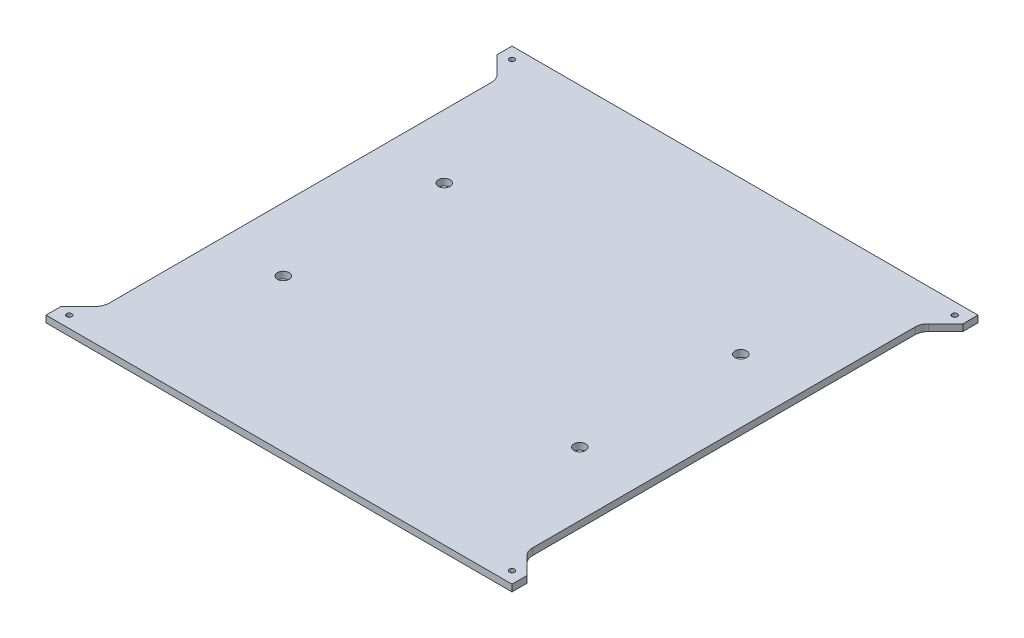
ISO-10303-21;
HEADER;
FILE_DESCRIPTION(('STEP AP214'),'2;1');
FILE_NAME('part.step','',(''),(''),'','','');
FILE_SCHEMA(('AUTOMOTIVE_DESIGN { 1 0 10303 214 1 1 1 1 }'));
ENDSEC;
DATA;
#1=APPLICATION_CONTEXT('core data for automotive mechanical design processes');
#2=APPLICATION_PROTOCOL_DEFINITION('international standard','automotive_design',2000,#1);
#3=PRODUCT_CONTEXT('',#1,'mechanical');
#4=PRODUCT('Part','Part','',(#3));
#5=PRODUCT_RELATED_PRODUCT_CATEGORY('part','',(#4));
#6=PRODUCT_DEFINITION_FORMATION('','',#4);
#7=PRODUCT_DEFINITION_CONTEXT('part definition',#1,'design');
#8=PRODUCT_DEFINITION('design','',#6,#7);
#9=PRODUCT_DEFINITION_SHAPE('','',#8);
#10=(LENGTH_UNIT() NAMED_UNIT(*) SI_UNIT(.MILLI.,.METRE.));
#11=(NAMED_UNIT(*) PLANE_ANGLE_UNIT() SI_UNIT($,.RADIAN.));
#12=(NAMED_UNIT(*) SI_UNIT($,.STERADIAN.) SOLID_ANGLE_UNIT());
#13=UNCERTAINTY_MEASURE_WITH_UNIT(LENGTH_MEASURE(1.E-05),#10,'distance_accuracy_value','');
#14=(GEOMETRIC_REPRESENTATION_CONTEXT(3) GLOBAL_UNCERTAINTY_ASSIGNED_CONTEXT((#13)) GLOBAL_UNIT_ASSIGNED_CONTEXT((#10,
#11,#12)) REPRESENTATION_CONTEXT('',''));
#15=CARTESIAN_POINT('',(0.,0.,0.));
#16=DIRECTION('',(0.,0.,1.));
#17=DIRECTION('',(1.,0.,0.));
#18=AXIS2_PLACEMENT_3D('',#15,#16,#17);
#19=CARTESIAN_POINT('',(110.,3.175,-110.));
#20=DIRECTION('',(-1.,0.,0.));
#21=DIRECTION('',(0.,0.,1.));
#22=AXIS2_PLACEMENT_3D('',#19,#20,#21);
#23=PLANE('',#22);
#24=DIRECTION('',(0.,0.,-1.));
#25=VECTOR('',#24,1.);
#26=CARTESIAN_POINT('',(110.,0.,-110.));
#27=LINE('',#26,#25);
#28=CARTESIAN_POINT('',(110.,0.,110.));
#29=VERTEX_POINT('',#28);
#30=CARTESIAN_POINT('',(110.,0.,102.928932188135));
#31=VERTEX_POINT('',#30);
#32=EDGE_CURVE('E172',#29,#31,#27,.T.);
#33=ORIENTED_EDGE('',*,*,#32,.T.);
#34=DIRECTION('',(0.,1.,0.));
#35=VECTOR('',#34,1.);
#36=CARTESIAN_POINT('',(110.,0.,102.928932188135));
#37=LINE('',#36,#35);
#38=CARTESIAN_POINT('',(110.,3.175,102.928932188135));
#39=VERTEX_POINT('',#38);
#40=EDGE_CURVE('E222',#31,#39,#37,.T.);
#41=ORIENTED_EDGE('',*,*,#40,.T.);
#42=DIRECTION('',(0.,0.,-1.));
#43=VECTOR('',#42,1.);
#44=CARTESIAN_POINT('',(110.,3.175,-110.));
#45=LINE('',#44,#43);
#46=CARTESIAN_POINT('',(110.,3.175,110.));
#47=VERTEX_POINT('',#46);
#48=EDGE_CURVE('E194',#47,#39,#45,.T.);
#49=ORIENTED_EDGE('',*,*,#48,.F.);
#50=DIRECTION('',(0.,-1.,0.));
#51=VECTOR('',#50,1.);
#52=CARTESIAN_POINT('',(110.,3.175,110.));
#53=LINE('',#52,#51);
#54=EDGE_CURVE('E43',#47,#29,#53,.T.);
#55=ORIENTED_EDGE('',*,*,#54,.T.);
#56=EDGE_LOOP('',(#33,#41,#49,#55));
#57=FACE_BOUND('',#56,.T.);
#58=ADVANCED_FACE('F35',(#57),#23,.F.);
#59=CARTESIAN_POINT('',(-110.,3.175,-110.));
#60=DIRECTION('',(1.,0.,0.));
#61=DIRECTION('',(0.,0.,-1.));
#62=AXIS2_PLACEMENT_3D('',#59,#60,#61);
#63=PLANE('',#62);
#64=DIRECTION('',(0.,0.,1.));
#65=VECTOR('',#64,1.);
#66=CARTESIAN_POINT('',(-110.,0.,-110.));
#67=LINE('',#66,#65);
#68=CARTESIAN_POINT('',(-110.,0.,-110.));
#69=VERTEX_POINT('',#68);
#70=CARTESIAN_POINT('',(-110.,0.,-102.928932188135));
#71=VERTEX_POINT('',#70);
#72=EDGE_CURVE('E176',#69,#71,#67,.T.);
#73=ORIENTED_EDGE('',*,*,#72,.T.);
#74=DIRECTION('',(0.,1.,0.));
#75=VECTOR('',#74,1.);
#76=CARTESIAN_POINT('',(-110.,0.,-102.928932188135));
#77=LINE('',#76,#75);
#78=CARTESIAN_POINT('',(-110.,3.175,-102.928932188135));
#79=VERTEX_POINT('',#78);
#80=EDGE_CURVE('E246',#71,#79,#77,.T.);
#81=ORIENTED_EDGE('',*,*,#80,.T.);
#82=DIRECTION('',(0.,0.,1.));
#83=VECTOR('',#82,1.);
#84=CARTESIAN_POINT('',(-110.,3.175,-110.));
#85=LINE('',#84,#83);
#86=CARTESIAN_POINT('',(-110.,3.175,-110.));
#87=VERTEX_POINT('',#86);
#88=EDGE_CURVE('E320',#87,#79,#85,.T.);
#89=ORIENTED_EDGE('',*,*,#88,.F.);
#90=DIRECTION('',(0.,-1.,0.));
#91=VECTOR('',#90,1.);
#92=CARTESIAN_POINT('',(-110.,3.175,-110.));
#93=LINE('',#92,#91);
#94=EDGE_CURVE('E182',#87,#69,#93,.T.);
#95=ORIENTED_EDGE('',*,*,#94,.T.);
#96=EDGE_LOOP('',(#73,#81,#89,#95));
#97=FACE_BOUND('',#96,.T.);
#98=ADVANCED_FACE('F354',(#97),#63,.F.);
#99=CARTESIAN_POINT('',(-110.,3.175,102.928932188134));
#100=VERTEX_POINT('',#99);
#101=CARTESIAN_POINT('',(-110.,3.175,110.));
#102=VERTEX_POINT('',#101);
#103=EDGE_CURVE('E181',#100,#102,#85,.T.);
#104=ORIENTED_EDGE('',*,*,#103,.F.);
#105=DIRECTION('',(0.,1.,0.));
#106=VECTOR('',#105,1.);
#107=CARTESIAN_POINT('',(-110.,0.,102.928932188134));
#108=LINE('',#107,#106);
#109=CARTESIAN_POINT('',(-110.,0.,102.928932188134));
#110=VERTEX_POINT('',#109);
#111=EDGE_CURVE('E268',#110,#100,#108,.T.);
#112=ORIENTED_EDGE('',*,*,#111,.F.);
#113=CARTESIAN_POINT('',(-110.,0.,110.));
#114=VERTEX_POINT('',#113);
#115=EDGE_CURVE('E319',#110,#114,#67,.T.);
#116=ORIENTED_EDGE('',*,*,#115,.T.);
#117=DIRECTION('',(0.,-1.,0.));
#118=VECTOR('',#117,1.);
#119=CARTESIAN_POINT('',(-110.,3.175,110.));
#120=LINE('',#119,#118);
#121=EDGE_CURVE('E11',#102,#114,#120,.T.);
#122=ORIENTED_EDGE('',*,*,#121,.F.);
#123=EDGE_LOOP('',(#104,#112,#116,#122));
#124=FACE_BOUND('',#123,.T.);
#125=ADVANCED_FACE('F37',(#124),#63,.F.);
#126=CARTESIAN_POINT('',(-110.,3.175,110.));
#127=DIRECTION('',(0.,0.,-1.));
#128=DIRECTION('',(-1.,0.,0.));
#129=AXIS2_PLACEMENT_3D('',#126,#127,#128);
#130=PLANE('',#129);
#131=DIRECTION('',(1.,0.,0.));
#132=VECTOR('',#131,1.);
#133=CARTESIAN_POINT('',(-110.,0.,110.));
#134=LINE('',#133,#132);
#135=EDGE_CURVE('E173',#114,#29,#134,.T.);
#136=ORIENTED_EDGE('',*,*,#135,.T.);
#137=ORIENTED_EDGE('',*,*,#54,.F.);
#138=DIRECTION('',(1.,0.,0.));
#139=VECTOR('',#138,1.);
#140=CARTESIAN_POINT('',(-110.,3.175,110.));
#141=LINE('',#140,#139);
#142=EDGE_CURVE('E323',#102,#47,#141,.T.);
#143=ORIENTED_EDGE('',*,*,#142,.F.);
#144=ORIENTED_EDGE('',*,*,#121,.T.);
#145=EDGE_LOOP('',(#136,#137,#143,#144));
#146=FACE_BOUND('',#145,.T.);
#147=ADVANCED_FACE('F366',(#146),#130,.F.);
#148=CARTESIAN_POINT('',(110.,3.175,-102.928932188135));
#149=VERTEX_POINT('',#148);
#150=CARTESIAN_POINT('',(110.,3.175,-110.));
#151=VERTEX_POINT('',#150);
#152=EDGE_CURVE('E164',#149,#151,#45,.T.);
#153=ORIENTED_EDGE('',*,*,#152,.F.);
#154=DIRECTION('',(0.,1.,0.));
#155=VECTOR('',#154,1.);
#156=CARTESIAN_POINT('',(110.,0.,-102.928932188135));
#157=LINE('',#156,#155);
#158=CARTESIAN_POINT('',(110.,0.,-102.928932188135));
#159=VERTEX_POINT('',#158);
#160=EDGE_CURVE('E151',#159,#149,#157,.T.);
#161=ORIENTED_EDGE('',*,*,#160,.F.);
#162=CARTESIAN_POINT('',(110.,0.,-110.));
#163=VERTEX_POINT('',#162);
#164=EDGE_CURVE('E162',#159,#163,#27,.T.);
#165=ORIENTED_EDGE('',*,*,#164,.T.);
#166=DIRECTION('',(0.,-1.,0.));
#167=VECTOR('',#166,1.);
#168=CARTESIAN_POINT('',(110.,3.175,-110.));
#169=LINE('',#168,#167);
#170=EDGE_CURVE('E185',#151,#163,#169,.T.);
#171=ORIENTED_EDGE('',*,*,#170,.F.);
#172=EDGE_LOOP('',(#153,#161,#165,#171));
#173=FACE_BOUND('',#172,.T.);
#174=ADVANCED_FACE('F160',(#173),#23,.F.);
#175=CARTESIAN_POINT('',(-110.,3.175,-110.));
#176=DIRECTION('',(0.,0.,1.));
#177=DIRECTION('',(1.,0.,0.));
#178=AXIS2_PLACEMENT_3D('',#175,#176,#177);
#179=PLANE('',#178);
#180=DIRECTION('',(-1.,0.,0.));
#181=VECTOR('',#180,1.);
#182=CARTESIAN_POINT('',(-110.,0.,-110.));
#183=LINE('',#182,#181);
#184=EDGE_CURVE('E171',#163,#69,#183,.T.);
#185=ORIENTED_EDGE('',*,*,#184,.T.);
#186=ORIENTED_EDGE('',*,*,#94,.F.);
#187=DIRECTION('',(-1.,0.,0.));
#188=VECTOR('',#187,1.);
#189=CARTESIAN_POINT('',(-110.,3.175,-110.));
#190=LINE('',#189,#188);
#191=EDGE_CURVE('E186',#151,#87,#190,.T.);
#192=ORIENTED_EDGE('',*,*,#191,.F.);
#193=ORIENTED_EDGE('',*,*,#170,.T.);
#194=EDGE_LOOP('',(#185,#186,#192,#193));
#195=FACE_BOUND('',#194,.T.);
#196=ADVANCED_FACE('F358',(#195),#179,.F.);
#197=CARTESIAN_POINT('',(-110.,3.175,110.));
#198=DIRECTION('',(0.,1.,0.));
#199=DIRECTION('',(0.,0.,1.));
#200=AXIS2_PLACEMENT_3D('',#197,#198,#199);
#201=PLANE('',#200);
#202=DIRECTION('',(0.707106781186547,0.,0.707106781186547));
#203=VECTOR('',#202,1.);
#204=CARTESIAN_POINT('',(101.859871939465,3.175,94.7888041276));
#205=LINE('',#204,#203);
#206=CARTESIAN_POINT('',(101.859871939465,3.175,94.7888041276));
#207=VERTEX_POINT('',#206);
#208=EDGE_CURVE('E156',#207,#39,#205,.T.);
#209=ORIENTED_EDGE('',*,*,#208,.F.);
#210=CARTESIAN_POINT('',(106.35,3.175,90.2986760670654));
#211=DIRECTION('',(0.,1.,0.));
#212=DIRECTION('',(0.,0.,1.));
#213=AXIS2_PLACEMENT_3D('',#210,#211,#212);
#214=CIRCLE('',#213,6.35);
#215=CARTESIAN_POINT('',(100.,3.175,90.2986760670654));
#216=VERTEX_POINT('',#215);
#217=EDGE_CURVE('E218',#216,#207,#214,.T.);
#218=ORIENTED_EDGE('',*,*,#217,.F.);
#219=DIRECTION('',(0.,0.,1.));
#220=VECTOR('',#219,1.);
#221=CARTESIAN_POINT('',(100.,3.175,-90.2986760670654));
#222=LINE('',#221,#220);
#223=CARTESIAN_POINT('',(100.,3.175,-90.2986760670654));
#224=VERTEX_POINT('',#223);
#225=EDGE_CURVE('E215',#224,#216,#222,.T.);
#226=ORIENTED_EDGE('',*,*,#225,.F.);
#227=CARTESIAN_POINT('',(106.35,3.175,-90.2986760670654));
#228=DIRECTION('',(0.,1.,0.));
#229=DIRECTION('',(0.,0.,1.));
#230=AXIS2_PLACEMENT_3D('',#227,#228,#229);
#231=CIRCLE('',#230,6.34999999999999);
#232=CARTESIAN_POINT('',(101.859871939465,3.175,-94.7888041276));
#233=VERTEX_POINT('',#232);
#234=EDGE_CURVE('E212',#233,#224,#231,.T.);
#235=ORIENTED_EDGE('',*,*,#234,.F.);
#236=DIRECTION('',(-0.707106781186548,0.,0.707106781186548));
#237=VECTOR('',#236,1.);
#238=CARTESIAN_POINT('',(110.,3.175,-102.928932188135));
#239=LINE('',#238,#237);
#240=EDGE_CURVE('E210',#149,#233,#239,.T.);
#241=ORIENTED_EDGE('',*,*,#240,.F.);
#242=ORIENTED_EDGE('',*,*,#152,.T.);
#243=ORIENTED_EDGE('',*,*,#191,.T.);
#244=ORIENTED_EDGE('',*,*,#88,.T.);
#245=DIRECTION('',(-0.707106781186548,0.,-0.707106781186548));
#246=VECTOR('',#245,1.);
#247=CARTESIAN_POINT('',(-101.859871939465,3.175,-94.7888041275999));
#248=LINE('',#247,#246);
#249=CARTESIAN_POINT('',(-101.859871939465,3.175,-94.7888041275999));
#250=VERTEX_POINT('',#249);
#251=EDGE_CURVE('E224',#250,#79,#248,.T.);
#252=ORIENTED_EDGE('',*,*,#251,.F.);
#253=CARTESIAN_POINT('',(-106.35,3.175,-90.2986760670654));
#254=DIRECTION('',(0.,1.,0.));
#255=DIRECTION('',(0.,0.,1.));
#256=AXIS2_PLACEMENT_3D('',#253,#254,#255);
#257=CIRCLE('',#256,6.34999999999999);
#258=CARTESIAN_POINT('',(-100.,3.175,-90.2986760670654));
#259=VERTEX_POINT('',#258);
#260=EDGE_CURVE('E236',#259,#250,#257,.T.);
#261=ORIENTED_EDGE('',*,*,#260,.F.);
#262=DIRECTION('',(0.,0.,-1.));
#263=VECTOR('',#262,1.);
#264=CARTESIAN_POINT('',(-100.,3.175,90.2986760670654));
#265=LINE('',#264,#263);
#266=CARTESIAN_POINT('',(-100.,3.175,90.2986760670654));
#267=VERTEX_POINT('',#266);
#268=EDGE_CURVE('E254',#267,#259,#265,.T.);
#269=ORIENTED_EDGE('',*,*,#268,.F.);
#270=CARTESIAN_POINT('',(-106.35,3.175,90.2986760670654));
#271=DIRECTION('',(0.,1.,0.));
#272=DIRECTION('',(0.,0.,1.));
#273=AXIS2_PLACEMENT_3D('',#270,#271,#272);
#274=CIRCLE('',#273,6.34999999999999);
#275=CARTESIAN_POINT('',(-101.859871939465,3.175,94.7888041275999));
#276=VERTEX_POINT('',#275);
#277=EDGE_CURVE('E251',#276,#267,#274,.T.);
#278=ORIENTED_EDGE('',*,*,#277,.F.);
#279=DIRECTION('',(0.707106781186548,0.,-0.707106781186548));
#280=VECTOR('',#279,1.);
#281=CARTESIAN_POINT('',(-110.,3.175,102.928932188134));
#282=LINE('',#281,#280);
#283=EDGE_CURVE('E248',#100,#276,#282,.T.);
#284=ORIENTED_EDGE('',*,*,#283,.F.);
#285=ORIENTED_EDGE('',*,*,#103,.T.);
#286=ORIENTED_EDGE('',*,*,#142,.T.);
#287=ORIENTED_EDGE('',*,*,#48,.T.);
#288=EDGE_LOOP('',(#209,#218,#226,#235,#241,#242,#243,#244,#252,#261,#269,#278,#284,#285,#286,#287));
#289=FACE_BOUND('',#288,.T.);
#290=CARTESIAN_POINT('',(70.,3.175,-38.));
#291=DIRECTION('',(0.,1.,0.));
#292=DIRECTION('',(0.,0.,1.));
#293=AXIS2_PLACEMENT_3D('',#290,#291,#292);
#294=CIRCLE('',#293,2.75000000000001);
#295=CARTESIAN_POINT('',(70.,3.175,-35.25));
#296=VERTEX_POINT('',#295);
#297=EDGE_CURVE('E261',#296,#296,#294,.T.);
#298=ORIENTED_EDGE('',*,*,#297,.F.);
#299=EDGE_LOOP('',(#298));
#300=FACE_BOUND('',#299,.T.);
#301=CARTESIAN_POINT('',(70.,3.175,38.));
#302=DIRECTION('',(0.,1.,0.));
#303=DIRECTION('',(0.,0.,1.));
#304=AXIS2_PLACEMENT_3D('',#301,#302,#303);
#305=CIRCLE('',#304,2.75000000000001);
#306=CARTESIAN_POINT('',(70.,3.175,40.75));
#307=VERTEX_POINT('',#306);
#308=EDGE_CURVE('E275',#307,#307,#305,.T.);
#309=ORIENTED_EDGE('',*,*,#308,.F.);
#310=EDGE_LOOP('',(#309));
#311=FACE_BOUND('',#310,.T.);
#312=CARTESIAN_POINT('',(-70.,3.175,38.));
#313=DIRECTION('',(0.,1.,0.));
#314=DIRECTION('',(0.,0.,1.));
#315=AXIS2_PLACEMENT_3D('',#312,#313,#314);
#316=CIRCLE('',#315,2.75000000000001);
#317=CARTESIAN_POINT('',(-70.,3.175,40.75));
#318=VERTEX_POINT('',#317);
#319=EDGE_CURVE('E281',#318,#318,#316,.T.);
#320=ORIENTED_EDGE('',*,*,#319,.F.);
#321=EDGE_LOOP('',(#320));
#322=FACE_BOUND('',#321,.T.);
#323=CARTESIAN_POINT('',(-70.,3.175,-38.));
#324=DIRECTION('',(0.,1.,0.));
#325=DIRECTION('',(0.,0.,1.));
#326=AXIS2_PLACEMENT_3D('',#323,#324,#325);
#327=CIRCLE('',#326,2.75000000000001);
#328=CARTESIAN_POINT('',(-70.,3.175,-35.25));
#329=VERTEX_POINT('',#328);
#330=EDGE_CURVE('E287',#329,#329,#327,.T.);
#331=ORIENTED_EDGE('',*,*,#330,.F.);
#332=EDGE_LOOP('',(#331));
#333=FACE_BOUND('',#332,.T.);
#334=CARTESIAN_POINT('',(-104.5,3.175,-104.5));
#335=DIRECTION('',(0.,1.,0.));
#336=DIRECTION('',(0.,0.,1.));
#337=AXIS2_PLACEMENT_3D('',#334,#335,#336);
#338=CIRCLE('',#337,1.25);
#339=CARTESIAN_POINT('',(-104.5,3.175,-103.25));
#340=VERTEX_POINT('',#339);
#341=EDGE_CURVE('E293',#340,#340,#338,.T.);
#342=ORIENTED_EDGE('',*,*,#341,.F.);
#343=EDGE_LOOP('',(#342));
#344=FACE_BOUND('',#343,.T.);
#345=CARTESIAN_POINT('',(104.5,3.175,-104.5));
#346=DIRECTION('',(0.,1.,0.));
#347=DIRECTION('',(0.,0.,1.));
#348=AXIS2_PLACEMENT_3D('',#345,#346,#347);
#349=CIRCLE('',#348,1.25);
#350=CARTESIAN_POINT('',(104.5,3.175,-103.25));
#351=VERTEX_POINT('',#350);
#352=EDGE_CURVE('E301',#351,#351,#349,.T.);
#353=ORIENTED_EDGE('',*,*,#352,.F.);
#354=EDGE_LOOP('',(#353));
#355=FACE_BOUND('',#354,.T.);
#356=CARTESIAN_POINT('',(104.5,3.175,104.5));
#357=DIRECTION('',(0.,1.,0.));
#358=DIRECTION('',(0.,0.,1.));
#359=AXIS2_PLACEMENT_3D('',#356,#357,#358);
#360=CIRCLE('',#359,1.25);
#361=CARTESIAN_POINT('',(104.5,3.175,105.75));
#362=VERTEX_POINT('',#361);
#363=EDGE_CURVE('E307',#362,#362,#360,.T.);
#364=ORIENTED_EDGE('',*,*,#363,.F.);
#365=EDGE_LOOP('',(#364));
#366=FACE_BOUND('',#365,.T.);
#367=CARTESIAN_POINT('',(-104.5,3.175,104.5));
#368=DIRECTION('',(0.,1.,0.));
#369=DIRECTION('',(0.,0.,1.));
#370=AXIS2_PLACEMENT_3D('',#367,#368,#369);
#371=CIRCLE('',#370,1.25);
#372=CARTESIAN_POINT('',(-104.5,3.175,105.75));
#373=VERTEX_POINT('',#372);
#374=EDGE_CURVE('E313',#373,#373,#371,.T.);
#375=ORIENTED_EDGE('',*,*,#374,.F.);
#376=EDGE_LOOP('',(#375));
#377=FACE_BOUND('',#376,.T.);
#378=ADVANCED_FACE('F342',(#289,#300,#311,#322,#333,#344,#355,#366,#377),#201,.T.);
#379=CARTESIAN_POINT('',(-110.,0.,110.));
#380=DIRECTION('',(0.,1.,0.));
#381=DIRECTION('',(0.,0.,1.));
#382=AXIS2_PLACEMENT_3D('',#379,#380,#381);
#383=PLANE('',#382);
#384=CARTESIAN_POINT('',(70.,0.,-38.));
#385=DIRECTION('',(0.,1.,0.));
#386=DIRECTION('',(0.,0.,1.));
#387=AXIS2_PLACEMENT_3D('',#384,#385,#386);
#388=CIRCLE('',#387,2.75000000000001);
#389=CARTESIAN_POINT('',(70.,0.,-35.25));
#390=VERTEX_POINT('',#389);
#391=EDGE_CURVE('E272',#390,#390,#388,.T.);
#392=ORIENTED_EDGE('',*,*,#391,.T.);
#393=EDGE_LOOP('',(#392));
#394=FACE_BOUND('',#393,.T.);
#395=CARTESIAN_POINT('',(70.,0.,38.));
#396=DIRECTION('',(0.,1.,0.));
#397=DIRECTION('',(0.,0.,1.));
#398=AXIS2_PLACEMENT_3D('',#395,#396,#397);
#399=CIRCLE('',#398,2.75000000000001);
#400=CARTESIAN_POINT('',(70.,0.,40.75));
#401=VERTEX_POINT('',#400);
#402=EDGE_CURVE('E278',#401,#401,#399,.T.);
#403=ORIENTED_EDGE('',*,*,#402,.T.);
#404=EDGE_LOOP('',(#403));
#405=FACE_BOUND('',#404,.T.);
#406=CARTESIAN_POINT('',(-70.,0.,38.));
#407=DIRECTION('',(0.,1.,0.));
#408=DIRECTION('',(0.,0.,1.));
#409=AXIS2_PLACEMENT_3D('',#406,#407,#408);
#410=CIRCLE('',#409,2.75000000000001);
#411=CARTESIAN_POINT('',(-70.,0.,40.75));
#412=VERTEX_POINT('',#411);
#413=EDGE_CURVE('E284',#412,#412,#410,.T.);
#414=ORIENTED_EDGE('',*,*,#413,.T.);
#415=EDGE_LOOP('',(#414));
#416=FACE_BOUND('',#415,.T.);
#417=CARTESIAN_POINT('',(-70.,0.,-38.));
#418=DIRECTION('',(0.,1.,0.));
#419=DIRECTION('',(0.,0.,1.));
#420=AXIS2_PLACEMENT_3D('',#417,#418,#419);
#421=CIRCLE('',#420,2.75000000000001);
#422=CARTESIAN_POINT('',(-70.,0.,-35.25));
#423=VERTEX_POINT('',#422);
#424=EDGE_CURVE('E290',#423,#423,#421,.T.);
#425=ORIENTED_EDGE('',*,*,#424,.T.);
#426=EDGE_LOOP('',(#425));
#427=FACE_BOUND('',#426,.T.);
#428=CARTESIAN_POINT('',(-104.5,0.,-104.5));
#429=DIRECTION('',(0.,1.,0.));
#430=DIRECTION('',(0.,0.,1.));
#431=AXIS2_PLACEMENT_3D('',#428,#429,#430);
#432=CIRCLE('',#431,1.25);
#433=CARTESIAN_POINT('',(-104.5,0.,-103.25));
#434=VERTEX_POINT('',#433);
#435=EDGE_CURVE('E298',#434,#434,#432,.T.);
#436=ORIENTED_EDGE('',*,*,#435,.T.);
#437=EDGE_LOOP('',(#436));
#438=FACE_BOUND('',#437,.T.);
#439=CARTESIAN_POINT('',(104.5,0.,-104.5));
#440=DIRECTION('',(0.,1.,0.));
#441=DIRECTION('',(0.,0.,1.));
#442=AXIS2_PLACEMENT_3D('',#439,#440,#441);
#443=CIRCLE('',#442,1.25);
#444=CARTESIAN_POINT('',(104.5,0.,-103.25));
#445=VERTEX_POINT('',#444);
#446=EDGE_CURVE('E304',#445,#445,#443,.T.);
#447=ORIENTED_EDGE('',*,*,#446,.T.);
#448=EDGE_LOOP('',(#447));
#449=FACE_BOUND('',#448,.T.);
#450=CARTESIAN_POINT('',(104.5,0.,104.5));
#451=DIRECTION('',(0.,1.,0.));
#452=DIRECTION('',(0.,0.,1.));
#453=AXIS2_PLACEMENT_3D('',#450,#451,#452);
#454=CIRCLE('',#453,1.25);
#455=CARTESIAN_POINT('',(104.5,0.,105.75));
#456=VERTEX_POINT('',#455);
#457=EDGE_CURVE('E310',#456,#456,#454,.T.);
#458=ORIENTED_EDGE('',*,*,#457,.T.);
#459=EDGE_LOOP('',(#458));
#460=FACE_BOUND('',#459,.T.);
#461=CARTESIAN_POINT('',(-104.5,0.,104.5));
#462=DIRECTION('',(0.,1.,0.));
#463=DIRECTION('',(0.,0.,1.));
#464=AXIS2_PLACEMENT_3D('',#461,#462,#463);
#465=CIRCLE('',#464,1.25);
#466=CARTESIAN_POINT('',(-104.5,0.,105.75));
#467=VERTEX_POINT('',#466);
#468=EDGE_CURVE('E316',#467,#467,#465,.T.);
#469=ORIENTED_EDGE('',*,*,#468,.T.);
#470=EDGE_LOOP('',(#469));
#471=FACE_BOUND('',#470,.T.);
#472=CARTESIAN_POINT('',(106.35,0.,90.2986760670654));
#473=DIRECTION('',(0.,1.,0.));
#474=DIRECTION('',(0.,0.,1.));
#475=AXIS2_PLACEMENT_3D('',#472,#473,#474);
#476=CIRCLE('',#475,6.35);
#477=CARTESIAN_POINT('',(100.,0.,90.2986760670654));
#478=VERTEX_POINT('',#477);
#479=CARTESIAN_POINT('',(101.859871939465,0.,94.7888041276));
#480=VERTEX_POINT('',#479);
#481=EDGE_CURVE('E203',#478,#480,#476,.T.);
#482=ORIENTED_EDGE('',*,*,#481,.T.);
#483=DIRECTION('',(0.707106781186547,0.,0.707106781186547));
#484=VECTOR('',#483,1.);
#485=CARTESIAN_POINT('',(101.859871939465,0.,94.7888041276));
#486=LINE('',#485,#484);
#487=EDGE_CURVE('E165',#480,#31,#486,.T.);
#488=ORIENTED_EDGE('',*,*,#487,.T.);
#489=ORIENTED_EDGE('',*,*,#32,.F.);
#490=ORIENTED_EDGE('',*,*,#135,.F.);
#491=ORIENTED_EDGE('',*,*,#115,.F.);
#492=DIRECTION('',(0.707106781186548,0.,-0.707106781186548));
#493=VECTOR('',#492,1.);
#494=CARTESIAN_POINT('',(-110.,0.,102.928932188134));
#495=LINE('',#494,#493);
#496=CARTESIAN_POINT('',(-101.859871939465,0.,94.7888041275999));
#497=VERTEX_POINT('',#496);
#498=EDGE_CURVE('E235',#110,#497,#495,.T.);
#499=ORIENTED_EDGE('',*,*,#498,.T.);
#500=CARTESIAN_POINT('',(-106.35,0.,90.2986760670654));
#501=DIRECTION('',(0.,1.,0.));
#502=DIRECTION('',(0.,0.,1.));
#503=AXIS2_PLACEMENT_3D('',#500,#501,#502);
#504=CIRCLE('',#503,6.34999999999999);
#505=CARTESIAN_POINT('',(-100.,0.,90.2986760670654));
#506=VERTEX_POINT('',#505);
#507=EDGE_CURVE('E58',#497,#506,#504,.T.);
#508=ORIENTED_EDGE('',*,*,#507,.T.);
#509=DIRECTION('',(0.,0.,-1.));
#510=VECTOR('',#509,1.);
#511=CARTESIAN_POINT('',(-100.,0.,90.2986760670654));
#512=LINE('',#511,#510);
#513=CARTESIAN_POINT('',(-100.,0.,-90.2986760670654));
#514=VERTEX_POINT('',#513);
#515=EDGE_CURVE('E240',#506,#514,#512,.T.);
#516=ORIENTED_EDGE('',*,*,#515,.T.);
#517=CARTESIAN_POINT('',(-106.35,0.,-90.2986760670654));
#518=DIRECTION('',(0.,1.,0.));
#519=DIRECTION('',(0.,0.,1.));
#520=AXIS2_PLACEMENT_3D('',#517,#518,#519);
#521=CIRCLE('',#520,6.34999999999999);
#522=CARTESIAN_POINT('',(-101.859871939465,0.,-94.7888041275999));
#523=VERTEX_POINT('',#522);
#524=EDGE_CURVE('E243',#514,#523,#521,.T.);
#525=ORIENTED_EDGE('',*,*,#524,.T.);
#526=DIRECTION('',(-0.707106781186548,0.,-0.707106781186548));
#527=VECTOR('',#526,1.);
#528=CARTESIAN_POINT('',(-101.859871939465,0.,-94.7888041275999));
#529=LINE('',#528,#527);
#530=EDGE_CURVE('E232',#523,#71,#529,.T.);
#531=ORIENTED_EDGE('',*,*,#530,.T.);
#532=ORIENTED_EDGE('',*,*,#72,.F.);
#533=ORIENTED_EDGE('',*,*,#184,.F.);
#534=ORIENTED_EDGE('',*,*,#164,.F.);
#535=DIRECTION('',(-0.707106781186548,0.,0.707106781186548));
#536=VECTOR('',#535,1.);
#537=CARTESIAN_POINT('',(110.,0.,-102.928932188135));
#538=LINE('',#537,#536);
#539=CARTESIAN_POINT('',(101.859871939465,0.,-94.7888041276));
#540=VERTEX_POINT('',#539);
#541=EDGE_CURVE('E147',#159,#540,#538,.T.);
#542=ORIENTED_EDGE('',*,*,#541,.T.);
#543=CARTESIAN_POINT('',(106.35,0.,-90.2986760670654));
#544=DIRECTION('',(0.,1.,0.));
#545=DIRECTION('',(0.,0.,1.));
#546=AXIS2_PLACEMENT_3D('',#543,#544,#545);
#547=CIRCLE('',#546,6.34999999999999);
#548=CARTESIAN_POINT('',(100.,0.,-90.2986760670654));
#549=VERTEX_POINT('',#548);
#550=EDGE_CURVE('E50',#540,#549,#547,.T.);
#551=ORIENTED_EDGE('',*,*,#550,.T.);
#552=DIRECTION('',(0.,0.,1.));
#553=VECTOR('',#552,1.);
#554=CARTESIAN_POINT('',(100.,0.,-90.2986760670654));
#555=LINE('',#554,#553);
#556=EDGE_CURVE('E206',#549,#478,#555,.T.);
#557=ORIENTED_EDGE('',*,*,#556,.T.);
#558=EDGE_LOOP('',(#482,#488,#489,#490,#491,#499,#508,#516,#525,#531,#532,#533,#534,#542,#551,#557));
#559=FACE_BOUND('',#558,.T.);
#560=ADVANCED_FACE('F169',(#394,#405,#416,#427,#438,#449,#460,#471,#559),#383,.F.);
#561=CARTESIAN_POINT('',(-104.5,3.175,104.5));
#562=DIRECTION('',(0.,1.,0.));
#563=DIRECTION('',(0.,0.,1.));
#564=AXIS2_PLACEMENT_3D('',#561,#562,#563);
#565=CYLINDRICAL_SURFACE('',#564,1.25);
#566=ORIENTED_EDGE('',*,*,#468,.F.);
#567=EDGE_LOOP('',(#566));
#568=FACE_BOUND('',#567,.T.);
#569=ORIENTED_EDGE('',*,*,#374,.T.);
#570=EDGE_LOOP('',(#569));
#571=FACE_BOUND('',#570,.T.);
#572=ADVANCED_FACE('F435',(#568,#571),#565,.F.);
#573=CARTESIAN_POINT('',(104.5,3.175,104.5));
#574=DIRECTION('',(0.,1.,0.));
#575=DIRECTION('',(0.,0.,1.));
#576=AXIS2_PLACEMENT_3D('',#573,#574,#575);
#577=CYLINDRICAL_SURFACE('',#576,1.25);
#578=ORIENTED_EDGE('',*,*,#457,.F.);
#579=EDGE_LOOP('',(#578));
#580=FACE_BOUND('',#579,.T.);
#581=ORIENTED_EDGE('',*,*,#363,.T.);
#582=EDGE_LOOP('',(#581));
#583=FACE_BOUND('',#582,.T.);
#584=ADVANCED_FACE('F431',(#580,#583),#577,.F.);
#585=CARTESIAN_POINT('',(104.5,3.175,-104.5));
#586=DIRECTION('',(0.,1.,0.));
#587=DIRECTION('',(0.,0.,1.));
#588=AXIS2_PLACEMENT_3D('',#585,#586,#587);
#589=CYLINDRICAL_SURFACE('',#588,1.25);
#590=ORIENTED_EDGE('',*,*,#446,.F.);
#591=EDGE_LOOP('',(#590));
#592=FACE_BOUND('',#591,.T.);
#593=ORIENTED_EDGE('',*,*,#352,.T.);
#594=EDGE_LOOP('',(#593));
#595=FACE_BOUND('',#594,.T.);
#596=ADVANCED_FACE('F427',(#592,#595),#589,.F.);
#597=CARTESIAN_POINT('',(-104.5,3.175,-104.5));
#598=DIRECTION('',(0.,1.,0.));
#599=DIRECTION('',(0.,0.,1.));
#600=AXIS2_PLACEMENT_3D('',#597,#598,#599);
#601=CYLINDRICAL_SURFACE('',#600,1.25);
#602=ORIENTED_EDGE('',*,*,#435,.F.);
#603=EDGE_LOOP('',(#602));
#604=FACE_BOUND('',#603,.T.);
#605=ORIENTED_EDGE('',*,*,#341,.T.);
#606=EDGE_LOOP('',(#605));
#607=FACE_BOUND('',#606,.T.);
#608=ADVANCED_FACE('F423',(#604,#607),#601,.F.);
#609=CARTESIAN_POINT('',(-70.,0.,-38.));
#610=DIRECTION('',(0.,1.,0.));
#611=DIRECTION('',(0.,0.,1.));
#612=AXIS2_PLACEMENT_3D('',#609,#610,#611);
#613=CYLINDRICAL_SURFACE('',#612,2.75000000000001);
#614=ORIENTED_EDGE('',*,*,#424,.F.);
#615=EDGE_LOOP('',(#614));
#616=FACE_BOUND('',#615,.T.);
#617=ORIENTED_EDGE('',*,*,#330,.T.);
#618=EDGE_LOOP('',(#617));
#619=FACE_BOUND('',#618,.T.);
#620=ADVANCED_FACE('F419',(#616,#619),#613,.F.);
#621=CARTESIAN_POINT('',(-70.,0.,38.));
#622=DIRECTION('',(0.,1.,0.));
#623=DIRECTION('',(0.,0.,1.));
#624=AXIS2_PLACEMENT_3D('',#621,#622,#623);
#625=CYLINDRICAL_SURFACE('',#624,2.75000000000001);
#626=ORIENTED_EDGE('',*,*,#413,.F.);
#627=EDGE_LOOP('',(#626));
#628=FACE_BOUND('',#627,.T.);
#629=ORIENTED_EDGE('',*,*,#319,.T.);
#630=EDGE_LOOP('',(#629));
#631=FACE_BOUND('',#630,.T.);
#632=ADVANCED_FACE('F415',(#628,#631),#625,.F.);
#633=CARTESIAN_POINT('',(70.,0.,38.));
#634=DIRECTION('',(0.,1.,0.));
#635=DIRECTION('',(0.,0.,1.));
#636=AXIS2_PLACEMENT_3D('',#633,#634,#635);
#637=CYLINDRICAL_SURFACE('',#636,2.75000000000001);
#638=ORIENTED_EDGE('',*,*,#402,.F.);
#639=EDGE_LOOP('',(#638));
#640=FACE_BOUND('',#639,.T.);
#641=ORIENTED_EDGE('',*,*,#308,.T.);
#642=EDGE_LOOP('',(#641));
#643=FACE_BOUND('',#642,.T.);
#644=ADVANCED_FACE('F411',(#640,#643),#637,.F.);
#645=CARTESIAN_POINT('',(70.,0.,-38.));
#646=DIRECTION('',(0.,1.,0.));
#647=DIRECTION('',(0.,0.,1.));
#648=AXIS2_PLACEMENT_3D('',#645,#646,#647);
#649=CYLINDRICAL_SURFACE('',#648,2.75000000000001);
#650=ORIENTED_EDGE('',*,*,#391,.F.);
#651=EDGE_LOOP('',(#650));
#652=FACE_BOUND('',#651,.T.);
#653=ORIENTED_EDGE('',*,*,#297,.T.);
#654=EDGE_LOOP('',(#653));
#655=FACE_BOUND('',#654,.T.);
#656=ADVANCED_FACE('F408',(#652,#655),#649,.F.);
#657=CARTESIAN_POINT('',(-101.859871939465,0.,-94.7888041275999));
#658=DIRECTION('',(0.707106781186548,0.,-0.707106781186548));
#659=DIRECTION('',(-0.707106781186548,0.,-0.707106781186548));
#660=AXIS2_PLACEMENT_3D('',#657,#658,#659);
#661=PLANE('',#660);
#662=ORIENTED_EDGE('',*,*,#251,.T.);
#663=ORIENTED_EDGE('',*,*,#80,.F.);
#664=ORIENTED_EDGE('',*,*,#530,.F.);
#665=DIRECTION('',(0.,1.,0.));
#666=VECTOR('',#665,1.);
#667=CARTESIAN_POINT('',(-101.859871939465,0.,-94.7888041275999));
#668=LINE('',#667,#666);
#669=EDGE_CURVE('E259',#523,#250,#668,.T.);
#670=ORIENTED_EDGE('',*,*,#669,.T.);
#671=EDGE_LOOP('',(#662,#663,#664,#670));
#672=FACE_BOUND('',#671,.T.);
#673=ADVANCED_FACE('F352',(#672),#661,.F.);
#674=CARTESIAN_POINT('',(-106.35,0.,-90.2986760670654));
#675=DIRECTION('',(0.,1.,0.));
#676=DIRECTION('',(0.,0.,1.));
#677=AXIS2_PLACEMENT_3D('',#674,#675,#676);
#678=CYLINDRICAL_SURFACE('',#677,6.34999999999999);
#679=ORIENTED_EDGE('',*,*,#260,.T.);
#680=ORIENTED_EDGE('',*,*,#669,.F.);
#681=ORIENTED_EDGE('',*,*,#524,.F.);
#682=DIRECTION('',(0.,1.,0.));
#683=VECTOR('',#682,1.);
#684=CARTESIAN_POINT('',(-100.,0.,-90.2986760670654));
#685=LINE('',#684,#683);
#686=EDGE_CURVE('E262',#514,#259,#685,.T.);
#687=ORIENTED_EDGE('',*,*,#686,.T.);
#688=EDGE_LOOP('',(#679,#680,#681,#687));
#689=FACE_BOUND('',#688,.T.);
#690=ADVANCED_FACE('F350',(#689),#678,.F.);
#691=CARTESIAN_POINT('',(-100.,0.,90.2986760670654));
#692=DIRECTION('',(1.,0.,0.));
#693=DIRECTION('',(0.,0.,-1.));
#694=AXIS2_PLACEMENT_3D('',#691,#692,#693);
#695=PLANE('',#694);
#696=ORIENTED_EDGE('',*,*,#268,.T.);
#697=ORIENTED_EDGE('',*,*,#686,.F.);
#698=ORIENTED_EDGE('',*,*,#515,.F.);
#699=DIRECTION('',(0.,1.,0.));
#700=VECTOR('',#699,1.);
#701=CARTESIAN_POINT('',(-100.,0.,90.2986760670654));
#702=LINE('',#701,#700);
#703=EDGE_CURVE('E264',#506,#267,#702,.T.);
#704=ORIENTED_EDGE('',*,*,#703,.T.);
#705=EDGE_LOOP('',(#696,#697,#698,#704));
#706=FACE_BOUND('',#705,.T.);
#707=ADVANCED_FACE('F346',(#706),#695,.F.);
#708=CARTESIAN_POINT('',(-106.35,0.,90.2986760670654));
#709=DIRECTION('',(0.,1.,0.));
#710=DIRECTION('',(0.,0.,1.));
#711=AXIS2_PLACEMENT_3D('',#708,#709,#710);
#712=CYLINDRICAL_SURFACE('',#711,6.34999999999999);
#713=ORIENTED_EDGE('',*,*,#277,.T.);
#714=ORIENTED_EDGE('',*,*,#703,.F.);
#715=ORIENTED_EDGE('',*,*,#507,.F.);
#716=DIRECTION('',(0.,1.,0.));
#717=VECTOR('',#716,1.);
#718=CARTESIAN_POINT('',(-101.859871939465,0.,94.7888041275999));
#719=LINE('',#718,#717);
#720=EDGE_CURVE('E266',#497,#276,#719,.T.);
#721=ORIENTED_EDGE('',*,*,#720,.T.);
#722=EDGE_LOOP('',(#713,#714,#715,#721));
#723=FACE_BOUND('',#722,.T.);
#724=ADVANCED_FACE('F336',(#723),#712,.F.);
#725=CARTESIAN_POINT('',(-110.,0.,102.928932188134));
#726=DIRECTION('',(0.707106781186548,0.,0.707106781186548));
#727=DIRECTION('',(0.707106781186548,0.,-0.707106781186548));
#728=AXIS2_PLACEMENT_3D('',#725,#726,#727);
#729=PLANE('',#728);
#730=ORIENTED_EDGE('',*,*,#283,.T.);
#731=ORIENTED_EDGE('',*,*,#720,.F.);
#732=ORIENTED_EDGE('',*,*,#498,.F.);
#733=ORIENTED_EDGE('',*,*,#111,.T.);
#734=EDGE_LOOP('',(#730,#731,#732,#733));
#735=FACE_BOUND('',#734,.T.);
#736=ADVANCED_FACE('F333',(#735),#729,.F.);
#737=CARTESIAN_POINT('',(101.859871939465,0.,94.7888041276));
#738=DIRECTION('',(-0.707106781186548,0.,0.707106781186548));
#739=DIRECTION('',(0.707106781186548,0.,0.707106781186548));
#740=AXIS2_PLACEMENT_3D('',#737,#738,#739);
#741=PLANE('',#740);
#742=ORIENTED_EDGE('',*,*,#208,.T.);
#743=ORIENTED_EDGE('',*,*,#40,.F.);
#744=ORIENTED_EDGE('',*,*,#487,.F.);
#745=DIRECTION('',(0.,1.,0.));
#746=VECTOR('',#745,1.);
#747=CARTESIAN_POINT('',(101.859871939465,0.,94.7888041276));
#748=LINE('',#747,#746);
#749=EDGE_CURVE('E225',#480,#207,#748,.T.);
#750=ORIENTED_EDGE('',*,*,#749,.T.);
#751=EDGE_LOOP('',(#742,#743,#744,#750));
#752=FACE_BOUND('',#751,.T.);
#753=ADVANCED_FACE('F379',(#752),#741,.F.);
#754=CARTESIAN_POINT('',(106.35,0.,90.2986760670654));
#755=DIRECTION('',(0.,1.,0.));
#756=DIRECTION('',(0.,0.,1.));
#757=AXIS2_PLACEMENT_3D('',#754,#755,#756);
#758=CYLINDRICAL_SURFACE('',#757,6.35);
#759=ORIENTED_EDGE('',*,*,#217,.T.);
#760=ORIENTED_EDGE('',*,*,#749,.F.);
#761=ORIENTED_EDGE('',*,*,#481,.F.);
#762=DIRECTION('',(0.,1.,0.));
#763=VECTOR('',#762,1.);
#764=CARTESIAN_POINT('',(100.,0.,90.2986760670654));
#765=LINE('',#764,#763);
#766=EDGE_CURVE('E227',#478,#216,#765,.T.);
#767=ORIENTED_EDGE('',*,*,#766,.T.);
#768=EDGE_LOOP('',(#759,#760,#761,#767));
#769=FACE_BOUND('',#768,.T.);
#770=ADVANCED_FACE('F381',(#769),#758,.F.);
#771=CARTESIAN_POINT('',(100.,0.,-90.2986760670654));
#772=DIRECTION('',(-1.,0.,0.));
#773=DIRECTION('',(0.,0.,1.));
#774=AXIS2_PLACEMENT_3D('',#771,#772,#773);
#775=PLANE('',#774);
#776=ORIENTED_EDGE('',*,*,#225,.T.);
#777=ORIENTED_EDGE('',*,*,#766,.F.);
#778=ORIENTED_EDGE('',*,*,#556,.F.);
#779=DIRECTION('',(0.,1.,0.));
#780=VECTOR('',#779,1.);
#781=CARTESIAN_POINT('',(100.,0.,-90.2986760670654));
#782=LINE('',#781,#780);
#783=EDGE_CURVE('E229',#549,#224,#782,.T.);
#784=ORIENTED_EDGE('',*,*,#783,.T.);
#785=EDGE_LOOP('',(#776,#777,#778,#784));
#786=FACE_BOUND('',#785,.T.);
#787=ADVANCED_FACE('F384',(#786),#775,.F.);
#788=CARTESIAN_POINT('',(106.35,0.,-90.2986760670654));
#789=DIRECTION('',(0.,1.,0.));
#790=DIRECTION('',(0.,0.,1.));
#791=AXIS2_PLACEMENT_3D('',#788,#789,#790);
#792=CYLINDRICAL_SURFACE('',#791,6.34999999999999);
#793=ORIENTED_EDGE('',*,*,#234,.T.);
#794=ORIENTED_EDGE('',*,*,#783,.F.);
#795=ORIENTED_EDGE('',*,*,#550,.F.);
#796=DIRECTION('',(0.,1.,0.));
#797=VECTOR('',#796,1.);
#798=CARTESIAN_POINT('',(101.859871939465,0.,-94.7888041276));
#799=LINE('',#798,#797);
#800=EDGE_CURVE('E153',#540,#233,#799,.T.);
#801=ORIENTED_EDGE('',*,*,#800,.T.);
#802=EDGE_LOOP('',(#793,#794,#795,#801));
#803=FACE_BOUND('',#802,.T.);
#804=ADVANCED_FACE('F386',(#803),#792,.F.);
#805=CARTESIAN_POINT('',(110.,0.,-102.928932188135));
#806=DIRECTION('',(-0.707106781186548,0.,-0.707106781186548));
#807=DIRECTION('',(-0.707106781186548,0.,0.707106781186548));
#808=AXIS2_PLACEMENT_3D('',#805,#806,#807);
#809=PLANE('',#808);
#810=ORIENTED_EDGE('',*,*,#240,.T.);
#811=ORIENTED_EDGE('',*,*,#800,.F.);
#812=ORIENTED_EDGE('',*,*,#541,.F.);
#813=ORIENTED_EDGE('',*,*,#160,.T.);
#814=EDGE_LOOP('',(#810,#811,#812,#813));
#815=FACE_BOUND('',#814,.T.);
#816=ADVANCED_FACE('F150',(#815),#809,.F.);
#817=CLOSED_SHELL('',(#58,#98,#125,#147,#174,#196,#378,#560,#572,#584,#596,#608,#620,#632,#644,
#656,#673,#690,#707,#724,#736,#753,#770,#787,#804,#816));
#818=MANIFOLD_SOLID_BREP('B2',#817);
#819=ADVANCED_BREP_SHAPE_REPRESENTATION('',(#18,#818),#14);
#820=SHAPE_DEFINITION_REPRESENTATION(#9,#819);
ENDSEC;
END-ISO-10303-21;
